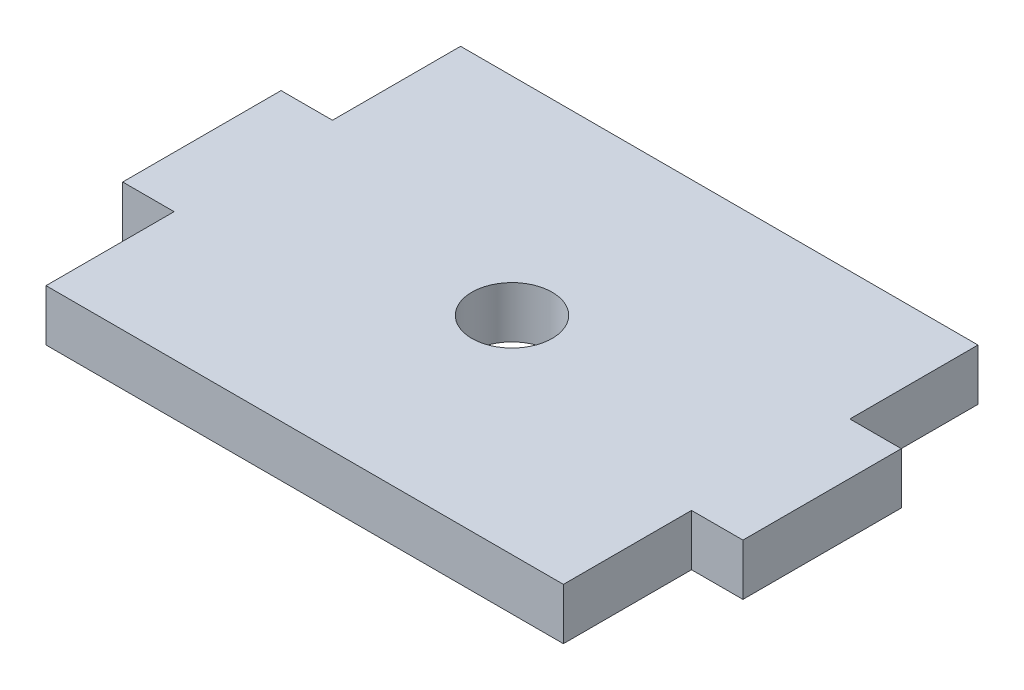
ISO-10303-21;
HEADER;
FILE_DESCRIPTION(('STEP AP214'),'2;1');
FILE_NAME('part.step','',(''),(''),'','','');
FILE_SCHEMA(('AUTOMOTIVE_DESIGN { 1 0 10303 214 1 1 1 1 }'));
ENDSEC;
DATA;
#1=APPLICATION_CONTEXT('core data for automotive mechanical design processes');
#2=APPLICATION_PROTOCOL_DEFINITION('international standard','automotive_design',2000,#1);
#3=PRODUCT_CONTEXT('',#1,'mechanical');
#4=PRODUCT('Part','Part','',(#3));
#5=PRODUCT_RELATED_PRODUCT_CATEGORY('part','',(#4));
#6=PRODUCT_DEFINITION_FORMATION('','',#4);
#7=PRODUCT_DEFINITION_CONTEXT('part definition',#1,'design');
#8=PRODUCT_DEFINITION('design','',#6,#7);
#9=PRODUCT_DEFINITION_SHAPE('','',#8);
#10=(LENGTH_UNIT() NAMED_UNIT(*) SI_UNIT(.MILLI.,.METRE.));
#11=(NAMED_UNIT(*) PLANE_ANGLE_UNIT() SI_UNIT($,.RADIAN.));
#12=(NAMED_UNIT(*) SI_UNIT($,.STERADIAN.) SOLID_ANGLE_UNIT());
#13=UNCERTAINTY_MEASURE_WITH_UNIT(LENGTH_MEASURE(1.E-05),#10,'distance_accuracy_value','');
#14=(GEOMETRIC_REPRESENTATION_CONTEXT(3) GLOBAL_UNCERTAINTY_ASSIGNED_CONTEXT((#13)) GLOBAL_UNIT_ASSIGNED_CONTEXT((#10,
#11,#12)) REPRESENTATION_CONTEXT('',''));
#15=CARTESIAN_POINT('',(0.,0.,0.));
#16=DIRECTION('',(0.,0.,1.));
#17=DIRECTION('',(1.,0.,0.));
#18=AXIS2_PLACEMENT_3D('',#15,#16,#17);
#19=CARTESIAN_POINT('',(0.,1.5875,0.));
#20=DIRECTION('',(0.,1.,0.));
#21=DIRECTION('',(0.,0.,1.));
#22=AXIS2_PLACEMENT_3D('',#19,#20,#21);
#23=PLANE('',#22);
#24=DIRECTION('',(0.,0.,1.));
#25=VECTOR('',#24,1.);
#26=CARTESIAN_POINT('',(-15.9766,1.5875,-12.8016));
#27=LINE('',#26,#25);
#28=CARTESIAN_POINT('',(-15.9766,1.5875,-12.8016));
#29=VERTEX_POINT('',#28);
#30=CARTESIAN_POINT('',(-15.9766,1.5875,-4.8895));
#31=VERTEX_POINT('',#30);
#32=EDGE_CURVE('E138',#29,#31,#27,.T.);
#33=ORIENTED_EDGE('',*,*,#32,.T.);
#34=DIRECTION('',(1.,0.,0.));
#35=VECTOR('',#34,1.);
#36=CARTESIAN_POINT('',(-19.1516,1.5875,-4.8895));
#37=LINE('',#36,#35);
#38=CARTESIAN_POINT('',(-19.1516,1.5875,-4.8895));
#39=VERTEX_POINT('',#38);
#40=EDGE_CURVE('E253',#39,#31,#37,.T.);
#41=ORIENTED_EDGE('',*,*,#40,.F.);
#42=DIRECTION('',(0.,0.,1.));
#43=VECTOR('',#42,1.);
#44=CARTESIAN_POINT('',(-19.1516,1.5875,-4.8895));
#45=LINE('',#44,#43);
#46=CARTESIAN_POINT('',(-19.1516,1.5875,4.8895));
#47=VERTEX_POINT('',#46);
#48=EDGE_CURVE('E243',#39,#47,#45,.T.);
#49=ORIENTED_EDGE('',*,*,#48,.T.);
#50=DIRECTION('',(1.,0.,0.));
#51=VECTOR('',#50,1.);
#52=CARTESIAN_POINT('',(-19.1516,1.5875,4.8895));
#53=LINE('',#52,#51);
#54=CARTESIAN_POINT('',(-15.9766,1.5875,4.8895));
#55=VERTEX_POINT('',#54);
#56=EDGE_CURVE('E403',#47,#55,#53,.T.);
#57=ORIENTED_EDGE('',*,*,#56,.T.);
#58=DIRECTION('',(0.,0.,1.));
#59=VECTOR('',#58,1.);
#60=CARTESIAN_POINT('',(-15.9766,1.5875,4.8895));
#61=LINE('',#60,#59);
#62=CARTESIAN_POINT('',(-15.9766,1.5875,12.8016));
#63=VERTEX_POINT('',#62);
#64=EDGE_CURVE('E401',#55,#63,#61,.T.);
#65=ORIENTED_EDGE('',*,*,#64,.T.);
#66=DIRECTION('',(1.,0.,0.));
#67=VECTOR('',#66,1.);
#68=CARTESIAN_POINT('',(-15.9766,1.5875,12.8016));
#69=LINE('',#68,#67);
#70=CARTESIAN_POINT('',(15.9766,1.5875,12.8016));
#71=VERTEX_POINT('',#70);
#72=EDGE_CURVE('E405',#63,#71,#69,.T.);
#73=ORIENTED_EDGE('',*,*,#72,.T.);
#74=DIRECTION('',(0.,0.,1.));
#75=VECTOR('',#74,1.);
#76=CARTESIAN_POINT('',(15.9766,1.5875,4.8895));
#77=LINE('',#76,#75);
#78=CARTESIAN_POINT('',(15.9766,1.5875,4.8895));
#79=VERTEX_POINT('',#78);
#80=EDGE_CURVE('E396',#79,#71,#77,.T.);
#81=ORIENTED_EDGE('',*,*,#80,.F.);
#82=DIRECTION('',(1.,0.,0.));
#83=VECTOR('',#82,1.);
#84=CARTESIAN_POINT('',(15.9766,1.5875,4.8895));
#85=LINE('',#84,#83);
#86=CARTESIAN_POINT('',(19.1516,1.5875,4.8895));
#87=VERTEX_POINT('',#86);
#88=EDGE_CURVE('E412',#79,#87,#85,.T.);
#89=ORIENTED_EDGE('',*,*,#88,.T.);
#90=DIRECTION('',(0.,0.,1.));
#91=VECTOR('',#90,1.);
#92=CARTESIAN_POINT('',(19.1516,1.5875,-4.8895));
#93=LINE('',#92,#91);
#94=CARTESIAN_POINT('',(19.1516,1.5875,-4.8895));
#95=VERTEX_POINT('',#94);
#96=EDGE_CURVE('E183',#95,#87,#93,.T.);
#97=ORIENTED_EDGE('',*,*,#96,.F.);
#98=DIRECTION('',(1.,0.,0.));
#99=VECTOR('',#98,1.);
#100=CARTESIAN_POINT('',(15.9766,1.5875,-4.8895));
#101=LINE('',#100,#99);
#102=CARTESIAN_POINT('',(15.9766,1.5875,-4.8895));
#103=VERTEX_POINT('',#102);
#104=EDGE_CURVE('E170',#103,#95,#101,.T.);
#105=ORIENTED_EDGE('',*,*,#104,.F.);
#106=DIRECTION('',(0.,0.,1.));
#107=VECTOR('',#106,1.);
#108=CARTESIAN_POINT('',(15.9766,1.5875,-12.8016));
#109=LINE('',#108,#107);
#110=CARTESIAN_POINT('',(15.9766,1.5875,-12.8016));
#111=VERTEX_POINT('',#110);
#112=EDGE_CURVE('E181',#111,#103,#109,.T.);
#113=ORIENTED_EDGE('',*,*,#112,.F.);
#114=DIRECTION('',(1.,0.,0.));
#115=VECTOR('',#114,1.);
#116=CARTESIAN_POINT('',(-15.9766,1.5875,-12.8016));
#117=LINE('',#116,#115);
#118=EDGE_CURVE('E186',#29,#111,#117,.T.);
#119=ORIENTED_EDGE('',*,*,#118,.F.);
#120=EDGE_LOOP('',(#33,#41,#49,#57,#65,#73,#81,#89,#97,#105,#113,#119));
#121=FACE_BOUND('',#120,.T.);
#122=CARTESIAN_POINT('',(0.,1.5875,0.));
#123=DIRECTION('',(0.,1.,0.));
#124=DIRECTION('',(0.,0.,1.));
#125=AXIS2_PLACEMENT_3D('',#122,#123,#124);
#126=CIRCLE('',#125,2.4780875);
#127=CARTESIAN_POINT('',(0.,1.5875,2.47808750000002));
#128=VERTEX_POINT('',#127);
#129=EDGE_CURVE('E194',#128,#128,#126,.T.);
#130=ORIENTED_EDGE('',*,*,#129,.F.);
#131=EDGE_LOOP('',(#130));
#132=FACE_BOUND('',#131,.T.);
#133=ADVANCED_FACE('F72',(#121,#132),#23,.T.);
#134=CARTESIAN_POINT('',(0.,-1.5875,0.));
#135=DIRECTION('',(0.,1.,0.));
#136=DIRECTION('',(0.,0.,1.));
#137=AXIS2_PLACEMENT_3D('',#134,#135,#136);
#138=PLANE('',#137);
#139=DIRECTION('',(0.,0.,1.));
#140=VECTOR('',#139,1.);
#141=CARTESIAN_POINT('',(-15.9766,-1.5875,-12.8016));
#142=LINE('',#141,#140);
#143=CARTESIAN_POINT('',(-15.9766,-1.5875,-12.8016));
#144=VERTEX_POINT('',#143);
#145=CARTESIAN_POINT('',(-15.9766,-1.5875,-4.8895));
#146=VERTEX_POINT('',#145);
#147=EDGE_CURVE('E191',#144,#146,#142,.T.);
#148=ORIENTED_EDGE('',*,*,#147,.F.);
#149=DIRECTION('',(1.,0.,0.));
#150=VECTOR('',#149,1.);
#151=CARTESIAN_POINT('',(-15.9766,-1.5875,-12.8016));
#152=LINE('',#151,#150);
#153=CARTESIAN_POINT('',(15.9766,-1.5875,-12.8016));
#154=VERTEX_POINT('',#153);
#155=EDGE_CURVE('E218',#144,#154,#152,.T.);
#156=ORIENTED_EDGE('',*,*,#155,.T.);
#157=DIRECTION('',(0.,0.,1.));
#158=VECTOR('',#157,1.);
#159=CARTESIAN_POINT('',(15.9766,-1.5875,-12.8016));
#160=LINE('',#159,#158);
#161=CARTESIAN_POINT('',(15.9766,-1.5875,-4.8895));
#162=VERTEX_POINT('',#161);
#163=EDGE_CURVE('E216',#154,#162,#160,.T.);
#164=ORIENTED_EDGE('',*,*,#163,.T.);
#165=DIRECTION('',(1.,0.,0.));
#166=VECTOR('',#165,1.);
#167=CARTESIAN_POINT('',(15.9766,-1.5875,-4.8895));
#168=LINE('',#167,#166);
#169=CARTESIAN_POINT('',(19.1516,-1.5875,-4.8895));
#170=VERTEX_POINT('',#169);
#171=EDGE_CURVE('E172',#162,#170,#168,.T.);
#172=ORIENTED_EDGE('',*,*,#171,.T.);
#173=DIRECTION('',(0.,0.,1.));
#174=VECTOR('',#173,1.);
#175=CARTESIAN_POINT('',(19.1516,-1.5875,-4.8895));
#176=LINE('',#175,#174);
#177=CARTESIAN_POINT('',(19.1516,-1.5875,4.8895));
#178=VERTEX_POINT('',#177);
#179=EDGE_CURVE('E212',#170,#178,#176,.T.);
#180=ORIENTED_EDGE('',*,*,#179,.T.);
#181=DIRECTION('',(1.,0.,0.));
#182=VECTOR('',#181,1.);
#183=CARTESIAN_POINT('',(15.9766,-1.5875,4.8895));
#184=LINE('',#183,#182);
#185=CARTESIAN_POINT('',(15.9766,-1.5875,4.8895));
#186=VERTEX_POINT('',#185);
#187=EDGE_CURVE('E209',#186,#178,#184,.T.);
#188=ORIENTED_EDGE('',*,*,#187,.F.);
#189=DIRECTION('',(0.,0.,1.));
#190=VECTOR('',#189,1.);
#191=CARTESIAN_POINT('',(15.9766,-1.5875,4.8895));
#192=LINE('',#191,#190);
#193=CARTESIAN_POINT('',(15.9766,-1.5875,12.8016));
#194=VERTEX_POINT('',#193);
#195=EDGE_CURVE('E206',#186,#194,#192,.T.);
#196=ORIENTED_EDGE('',*,*,#195,.T.);
#197=DIRECTION('',(1.,0.,0.));
#198=VECTOR('',#197,1.);
#199=CARTESIAN_POINT('',(-15.9766,-1.5875,12.8016));
#200=LINE('',#199,#198);
#201=CARTESIAN_POINT('',(-15.9766,-1.5875,12.8016));
#202=VERTEX_POINT('',#201);
#203=EDGE_CURVE('E203',#202,#194,#200,.T.);
#204=ORIENTED_EDGE('',*,*,#203,.F.);
#205=DIRECTION('',(0.,0.,1.));
#206=VECTOR('',#205,1.);
#207=CARTESIAN_POINT('',(-15.9766,-1.5875,4.8895));
#208=LINE('',#207,#206);
#209=CARTESIAN_POINT('',(-15.9766,-1.5875,4.8895));
#210=VERTEX_POINT('',#209);
#211=EDGE_CURVE('E201',#210,#202,#208,.T.);
#212=ORIENTED_EDGE('',*,*,#211,.F.);
#213=DIRECTION('',(1.,0.,0.));
#214=VECTOR('',#213,1.);
#215=CARTESIAN_POINT('',(-19.1516,-1.5875,4.8895));
#216=LINE('',#215,#214);
#217=CARTESIAN_POINT('',(-19.1516,-1.5875,4.8895));
#218=VERTEX_POINT('',#217);
#219=EDGE_CURVE('E199',#218,#210,#216,.T.);
#220=ORIENTED_EDGE('',*,*,#219,.F.);
#221=DIRECTION('',(0.,0.,1.));
#222=VECTOR('',#221,1.);
#223=CARTESIAN_POINT('',(-19.1516,-1.5875,-4.8895));
#224=LINE('',#223,#222);
#225=CARTESIAN_POINT('',(-19.1516,-1.5875,-4.8895));
#226=VERTEX_POINT('',#225);
#227=EDGE_CURVE('E197',#226,#218,#224,.T.);
#228=ORIENTED_EDGE('',*,*,#227,.F.);
#229=DIRECTION('',(1.,0.,0.));
#230=VECTOR('',#229,1.);
#231=CARTESIAN_POINT('',(-19.1516,-1.5875,-4.8895));
#232=LINE('',#231,#230);
#233=EDGE_CURVE('E193',#226,#146,#232,.T.);
#234=ORIENTED_EDGE('',*,*,#233,.T.);
#235=EDGE_LOOP('',(#148,#156,#164,#172,#180,#188,#196,#204,#212,#220,#228,#234));
#236=FACE_BOUND('',#235,.T.);
#237=CARTESIAN_POINT('',(0.,-1.5875,0.));
#238=DIRECTION('',(0.,1.,0.));
#239=DIRECTION('',(0.,0.,1.));
#240=AXIS2_PLACEMENT_3D('',#237,#238,#239);
#241=CIRCLE('',#240,2.4780875);
#242=CARTESIAN_POINT('',(0.,-1.5875,2.47808750000002));
#243=VERTEX_POINT('',#242);
#244=EDGE_CURVE('E415',#243,#243,#241,.T.);
#245=ORIENTED_EDGE('',*,*,#244,.T.);
#246=EDGE_LOOP('',(#245));
#247=FACE_BOUND('',#246,.T.);
#248=ADVANCED_FACE('F249',(#236,#247),#138,.F.);
#249=CARTESIAN_POINT('',(-15.9766,1.5875,-12.8016));
#250=DIRECTION('',(1.,0.,0.));
#251=DIRECTION('',(0.,0.,-1.));
#252=AXIS2_PLACEMENT_3D('',#249,#250,#251);
#253=PLANE('',#252);
#254=ORIENTED_EDGE('',*,*,#147,.T.);
#255=DIRECTION('',(0.,-1.,0.));
#256=VECTOR('',#255,1.);
#257=CARTESIAN_POINT('',(-15.9766,1.5875,-4.8895));
#258=LINE('',#257,#256);
#259=EDGE_CURVE('E12',#31,#146,#258,.T.);
#260=ORIENTED_EDGE('',*,*,#259,.F.);
#261=ORIENTED_EDGE('',*,*,#32,.F.);
#262=DIRECTION('',(0.,-1.,0.));
#263=VECTOR('',#262,1.);
#264=CARTESIAN_POINT('',(-15.9766,1.5875,-12.8016));
#265=LINE('',#264,#263);
#266=EDGE_CURVE('E89',#29,#144,#265,.T.);
#267=ORIENTED_EDGE('',*,*,#266,.T.);
#268=EDGE_LOOP('',(#254,#260,#261,#267));
#269=FACE_BOUND('',#268,.T.);
#270=ADVANCED_FACE('F74',(#269),#253,.F.);
#271=CARTESIAN_POINT('',(-19.1516,1.5875,-4.8895));
#272=DIRECTION('',(0.,0.,-1.));
#273=DIRECTION('',(-1.,0.,0.));
#274=AXIS2_PLACEMENT_3D('',#271,#272,#273);
#275=PLANE('',#274);
#276=ORIENTED_EDGE('',*,*,#233,.F.);
#277=DIRECTION('',(0.,-1.,0.));
#278=VECTOR('',#277,1.);
#279=CARTESIAN_POINT('',(-19.1516,1.5875,-4.8895));
#280=LINE('',#279,#278);
#281=EDGE_CURVE('E81',#39,#226,#280,.T.);
#282=ORIENTED_EDGE('',*,*,#281,.F.);
#283=ORIENTED_EDGE('',*,*,#40,.T.);
#284=ORIENTED_EDGE('',*,*,#259,.T.);
#285=EDGE_LOOP('',(#276,#282,#283,#284));
#286=FACE_BOUND('',#285,.T.);
#287=ADVANCED_FACE('F252',(#286),#275,.T.);
#288=CARTESIAN_POINT('',(-19.1516,1.5875,-4.8895));
#289=DIRECTION('',(1.,0.,0.));
#290=DIRECTION('',(0.,0.,-1.));
#291=AXIS2_PLACEMENT_3D('',#288,#289,#290);
#292=PLANE('',#291);
#293=ORIENTED_EDGE('',*,*,#227,.T.);
#294=DIRECTION('',(0.,-1.,0.));
#295=VECTOR('',#294,1.);
#296=CARTESIAN_POINT('',(-19.1516,1.5875,4.8895));
#297=LINE('',#296,#295);
#298=EDGE_CURVE('E236',#47,#218,#297,.T.);
#299=ORIENTED_EDGE('',*,*,#298,.F.);
#300=ORIENTED_EDGE('',*,*,#48,.F.);
#301=ORIENTED_EDGE('',*,*,#281,.T.);
#302=EDGE_LOOP('',(#293,#299,#300,#301));
#303=FACE_BOUND('',#302,.T.);
#304=ADVANCED_FACE('F241',(#303),#292,.F.);
#305=CARTESIAN_POINT('',(-19.1516,1.5875,4.8895));
#306=DIRECTION('',(0.,0.,-1.));
#307=DIRECTION('',(-1.,0.,0.));
#308=AXIS2_PLACEMENT_3D('',#305,#306,#307);
#309=PLANE('',#308);
#310=ORIENTED_EDGE('',*,*,#219,.T.);
#311=DIRECTION('',(0.,-1.,0.));
#312=VECTOR('',#311,1.);
#313=CARTESIAN_POINT('',(-15.9766,1.5875,4.8895));
#314=LINE('',#313,#312);
#315=EDGE_CURVE('E233',#55,#210,#314,.T.);
#316=ORIENTED_EDGE('',*,*,#315,.F.);
#317=ORIENTED_EDGE('',*,*,#56,.F.);
#318=ORIENTED_EDGE('',*,*,#298,.T.);
#319=EDGE_LOOP('',(#310,#316,#317,#318));
#320=FACE_BOUND('',#319,.T.);
#321=ADVANCED_FACE('F280',(#320),#309,.F.);
#322=CARTESIAN_POINT('',(-15.9766,1.5875,4.8895));
#323=DIRECTION('',(1.,0.,0.));
#324=DIRECTION('',(0.,0.,-1.));
#325=AXIS2_PLACEMENT_3D('',#322,#323,#324);
#326=PLANE('',#325);
#327=ORIENTED_EDGE('',*,*,#211,.T.);
#328=DIRECTION('',(0.,-1.,0.));
#329=VECTOR('',#328,1.);
#330=CARTESIAN_POINT('',(-15.9766,1.5875,12.8016));
#331=LINE('',#330,#329);
#332=EDGE_CURVE('E230',#63,#202,#331,.T.);
#333=ORIENTED_EDGE('',*,*,#332,.F.);
#334=ORIENTED_EDGE('',*,*,#64,.F.);
#335=ORIENTED_EDGE('',*,*,#315,.T.);
#336=EDGE_LOOP('',(#327,#333,#334,#335));
#337=FACE_BOUND('',#336,.T.);
#338=ADVANCED_FACE('F285',(#337),#326,.F.);
#339=CARTESIAN_POINT('',(-15.9766,1.5875,12.8016));
#340=DIRECTION('',(0.,0.,-1.));
#341=DIRECTION('',(-1.,0.,0.));
#342=AXIS2_PLACEMENT_3D('',#339,#340,#341);
#343=PLANE('',#342);
#344=ORIENTED_EDGE('',*,*,#203,.T.);
#345=DIRECTION('',(0.,-1.,0.));
#346=VECTOR('',#345,1.);
#347=CARTESIAN_POINT('',(15.9766,1.5875,12.8016));
#348=LINE('',#347,#346);
#349=EDGE_CURVE('E228',#71,#194,#348,.T.);
#350=ORIENTED_EDGE('',*,*,#349,.F.);
#351=ORIENTED_EDGE('',*,*,#72,.F.);
#352=ORIENTED_EDGE('',*,*,#332,.T.);
#353=EDGE_LOOP('',(#344,#350,#351,#352));
#354=FACE_BOUND('',#353,.T.);
#355=ADVANCED_FACE('F289',(#354),#343,.F.);
#356=CARTESIAN_POINT('',(15.9766,1.5875,4.8895));
#357=DIRECTION('',(1.,0.,0.));
#358=DIRECTION('',(0.,0.,-1.));
#359=AXIS2_PLACEMENT_3D('',#356,#357,#358);
#360=PLANE('',#359);
#361=ORIENTED_EDGE('',*,*,#195,.F.);
#362=DIRECTION('',(0.,-1.,0.));
#363=VECTOR('',#362,1.);
#364=CARTESIAN_POINT('',(15.9766,1.5875,4.8895));
#365=LINE('',#364,#363);
#366=EDGE_CURVE('E226',#79,#186,#365,.T.);
#367=ORIENTED_EDGE('',*,*,#366,.F.);
#368=ORIENTED_EDGE('',*,*,#80,.T.);
#369=ORIENTED_EDGE('',*,*,#349,.T.);
#370=EDGE_LOOP('',(#361,#367,#368,#369));
#371=FACE_BOUND('',#370,.T.);
#372=ADVANCED_FACE('F293',(#371),#360,.T.);
#373=CARTESIAN_POINT('',(15.9766,1.5875,4.8895));
#374=DIRECTION('',(0.,0.,-1.));
#375=DIRECTION('',(-1.,0.,0.));
#376=AXIS2_PLACEMENT_3D('',#373,#374,#375);
#377=PLANE('',#376);
#378=ORIENTED_EDGE('',*,*,#187,.T.);
#379=DIRECTION('',(0.,-1.,0.));
#380=VECTOR('',#379,1.);
#381=CARTESIAN_POINT('',(19.1516,1.5875,4.8895));
#382=LINE('',#381,#380);
#383=EDGE_CURVE('E224',#87,#178,#382,.T.);
#384=ORIENTED_EDGE('',*,*,#383,.F.);
#385=ORIENTED_EDGE('',*,*,#88,.F.);
#386=ORIENTED_EDGE('',*,*,#366,.T.);
#387=EDGE_LOOP('',(#378,#384,#385,#386));
#388=FACE_BOUND('',#387,.T.);
#389=ADVANCED_FACE('F297',(#388),#377,.F.);
#390=CARTESIAN_POINT('',(19.1516,1.5875,-4.8895));
#391=DIRECTION('',(1.,0.,0.));
#392=DIRECTION('',(0.,0.,-1.));
#393=AXIS2_PLACEMENT_3D('',#390,#391,#392);
#394=PLANE('',#393);
#395=ORIENTED_EDGE('',*,*,#179,.F.);
#396=DIRECTION('',(0.,-1.,0.));
#397=VECTOR('',#396,1.);
#398=CARTESIAN_POINT('',(19.1516,1.5875,-4.8895));
#399=LINE('',#398,#397);
#400=EDGE_CURVE('E176',#95,#170,#399,.T.);
#401=ORIENTED_EDGE('',*,*,#400,.F.);
#402=ORIENTED_EDGE('',*,*,#96,.T.);
#403=ORIENTED_EDGE('',*,*,#383,.T.);
#404=EDGE_LOOP('',(#395,#401,#402,#403));
#405=FACE_BOUND('',#404,.T.);
#406=ADVANCED_FACE('F301',(#405),#394,.T.);
#407=CARTESIAN_POINT('',(15.9766,1.5875,-4.8895));
#408=DIRECTION('',(0.,0.,-1.));
#409=DIRECTION('',(-1.,0.,0.));
#410=AXIS2_PLACEMENT_3D('',#407,#408,#409);
#411=PLANE('',#410);
#412=ORIENTED_EDGE('',*,*,#171,.F.);
#413=DIRECTION('',(0.,-1.,0.));
#414=VECTOR('',#413,1.);
#415=CARTESIAN_POINT('',(15.9766,1.5875,-4.8895));
#416=LINE('',#415,#414);
#417=EDGE_CURVE('E167',#103,#162,#416,.T.);
#418=ORIENTED_EDGE('',*,*,#417,.F.);
#419=ORIENTED_EDGE('',*,*,#104,.T.);
#420=ORIENTED_EDGE('',*,*,#400,.T.);
#421=EDGE_LOOP('',(#412,#418,#419,#420));
#422=FACE_BOUND('',#421,.T.);
#423=ADVANCED_FACE('F169',(#422),#411,.T.);
#424=CARTESIAN_POINT('',(15.9766,1.5875,-12.8016));
#425=DIRECTION('',(1.,0.,0.));
#426=DIRECTION('',(0.,0.,-1.));
#427=AXIS2_PLACEMENT_3D('',#424,#425,#426);
#428=PLANE('',#427);
#429=ORIENTED_EDGE('',*,*,#163,.F.);
#430=DIRECTION('',(0.,-1.,0.));
#431=VECTOR('',#430,1.);
#432=CARTESIAN_POINT('',(15.9766,1.5875,-12.8016));
#433=LINE('',#432,#431);
#434=EDGE_CURVE('E126',#111,#154,#433,.T.);
#435=ORIENTED_EDGE('',*,*,#434,.F.);
#436=ORIENTED_EDGE('',*,*,#112,.T.);
#437=ORIENTED_EDGE('',*,*,#417,.T.);
#438=EDGE_LOOP('',(#429,#435,#436,#437));
#439=FACE_BOUND('',#438,.T.);
#440=ADVANCED_FACE('F185',(#439),#428,.T.);
#441=CARTESIAN_POINT('',(-15.9766,1.5875,-12.8016));
#442=DIRECTION('',(0.,0.,-1.));
#443=DIRECTION('',(-1.,0.,0.));
#444=AXIS2_PLACEMENT_3D('',#441,#442,#443);
#445=PLANE('',#444);
#446=ORIENTED_EDGE('',*,*,#155,.F.);
#447=ORIENTED_EDGE('',*,*,#266,.F.);
#448=ORIENTED_EDGE('',*,*,#118,.T.);
#449=ORIENTED_EDGE('',*,*,#434,.T.);
#450=EDGE_LOOP('',(#446,#447,#448,#449));
#451=FACE_BOUND('',#450,.T.);
#452=ADVANCED_FACE('F254',(#451),#445,.T.);
#453=CARTESIAN_POINT('',(0.,1.5875,0.));
#454=DIRECTION('',(0.,-1.,0.));
#455=DIRECTION('',(0.,0.,-1.));
#456=AXIS2_PLACEMENT_3D('',#453,#454,#455);
#457=CYLINDRICAL_SURFACE('',#456,2.4780875);
#458=ORIENTED_EDGE('',*,*,#129,.T.);
#459=EDGE_LOOP('',(#458));
#460=FACE_BOUND('',#459,.T.);
#461=ORIENTED_EDGE('',*,*,#244,.F.);
#462=EDGE_LOOP('',(#461));
#463=FACE_BOUND('',#462,.T.);
#464=ADVANCED_FACE('F256',(#460,#463),#457,.F.);
#465=CLOSED_SHELL('',(#133,#248,#270,#287,#304,#321,#338,#355,#372,#389,#406,#423,#440,#452,#464));
#466=MANIFOLD_SOLID_BREP('B2',#465);
#467=ADVANCED_BREP_SHAPE_REPRESENTATION('',(#18,#466),#14);
#468=SHAPE_DEFINITION_REPRESENTATION(#9,#467);
ENDSEC;
END-ISO-10303-21;
